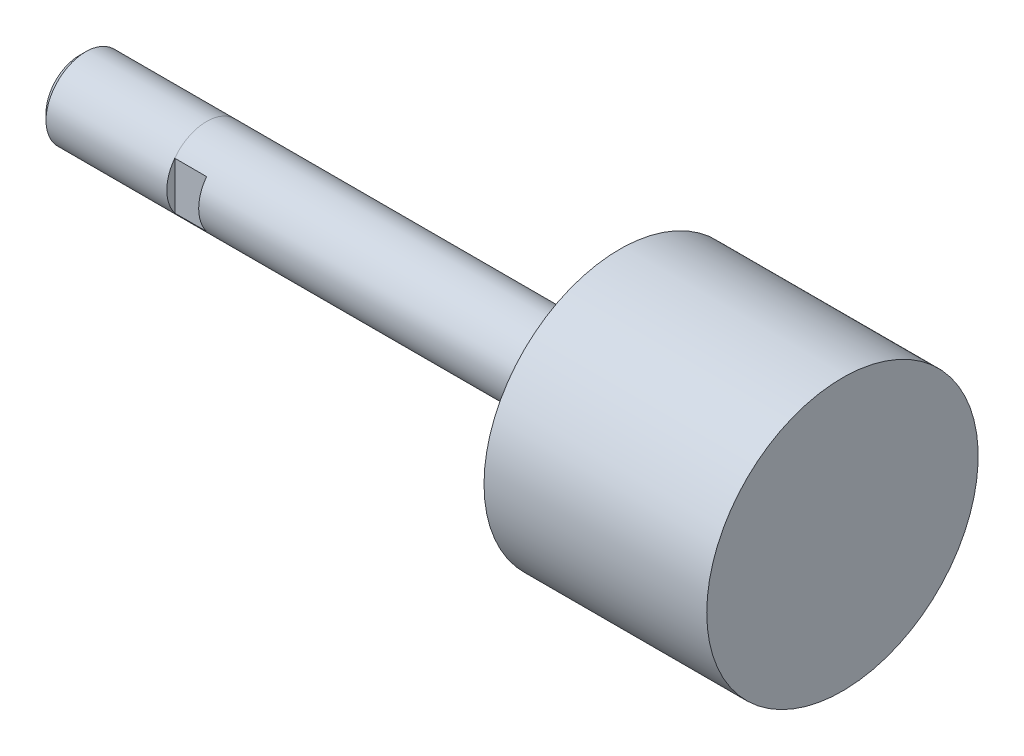
ISO-10303-21;
HEADER;
FILE_DESCRIPTION(('STEP AP214'),'2;1');
FILE_NAME('part.step','',(''),(''),'','','');
FILE_SCHEMA(('AUTOMOTIVE_DESIGN { 1 0 10303 214 1 1 1 1 }'));
ENDSEC;
DATA;
#1=APPLICATION_CONTEXT('core data for automotive mechanical design processes');
#2=APPLICATION_PROTOCOL_DEFINITION('international standard','automotive_design',2000,#1);
#3=PRODUCT_CONTEXT('',#1,'mechanical');
#4=PRODUCT('Part','Part','',(#3));
#5=PRODUCT_RELATED_PRODUCT_CATEGORY('part','',(#4));
#6=PRODUCT_DEFINITION_FORMATION('','',#4);
#7=PRODUCT_DEFINITION_CONTEXT('part definition',#1,'design');
#8=PRODUCT_DEFINITION('design','',#6,#7);
#9=PRODUCT_DEFINITION_SHAPE('','',#8);
#10=(LENGTH_UNIT() NAMED_UNIT(*) SI_UNIT(.MILLI.,.METRE.));
#11=(NAMED_UNIT(*) PLANE_ANGLE_UNIT() SI_UNIT($,.RADIAN.));
#12=(NAMED_UNIT(*) SI_UNIT($,.STERADIAN.) SOLID_ANGLE_UNIT());
#13=UNCERTAINTY_MEASURE_WITH_UNIT(LENGTH_MEASURE(1.E-05),#10,'distance_accuracy_value','');
#14=(GEOMETRIC_REPRESENTATION_CONTEXT(3) GLOBAL_UNCERTAINTY_ASSIGNED_CONTEXT((#13)) GLOBAL_UNIT_ASSIGNED_CONTEXT((#10,
#11,#12)) REPRESENTATION_CONTEXT('',''));
#15=CARTESIAN_POINT('',(0.,0.,0.));
#16=DIRECTION('',(0.,0.,1.));
#17=DIRECTION('',(1.,0.,0.));
#18=AXIS2_PLACEMENT_3D('',#15,#16,#17);
#19=CARTESIAN_POINT('',(60.3504,0.,0.));
#20=DIRECTION('',(-1.,0.,0.));
#21=DIRECTION('',(0.,0.,1.));
#22=AXIS2_PLACEMENT_3D('',#19,#20,#21);
#23=CYLINDRICAL_SURFACE('',#22,3.9624);
#24=DIRECTION('',(-1.,0.,0.));
#25=VECTOR('',#24,1.);
#26=CARTESIAN_POINT('',(60.3504,2.37065154757084,-3.175));
#27=LINE('',#26,#25);
#28=CARTESIAN_POINT('',(0.,2.37065154757084,-3.175));
#29=VERTEX_POINT('',#28);
#30=CARTESIAN_POINT('',(-3.175,2.37595077378542,-3.175));
#31=VERTEX_POINT('',#30);
#32=EDGE_CURVE('E100',#29,#31,#27,.T.);
#33=ORIENTED_EDGE('',*,*,#32,.T.);
#34=CARTESIAN_POINT('',(-3.175,0.,0.));
#35=DIRECTION('',(-1.,0.,0.));
#36=DIRECTION('',(0.,0.599143734238293,0.800641483888384));
#37=AXIS2_PLACEMENT_3D('',#34,#35,#36);
#38=CIRCLE('',#37,3.96875);
#39=CARTESIAN_POINT('',(-3.175,2.37594941390202,3.17500385247068));
#40=VERTEX_POINT('',#39);
#41=EDGE_CURVE('E80',#40,#31,#38,.T.);
#42=ORIENTED_EDGE('',*,*,#41,.F.);
#43=DIRECTION('',(-1.,0.,0.));
#44=VECTOR('',#43,1.);
#45=CARTESIAN_POINT('',(60.3504,2.37065154757084,3.175));
#46=LINE('',#45,#44);
#47=CARTESIAN_POINT('',(0.,2.37065154757084,3.175));
#48=VERTEX_POINT('',#47);
#49=EDGE_CURVE('E109',#40,#48,#46,.F.);
#50=ORIENTED_EDGE('',*,*,#49,.T.);
#51=CARTESIAN_POINT('',(0.,0.,0.));
#52=DIRECTION('',(1.,0.,0.));
#53=DIRECTION('',(0.,0.,-1.));
#54=AXIS2_PLACEMENT_3D('',#51,#52,#53);
#55=CIRCLE('',#54,3.9624);
#56=CARTESIAN_POINT('',(0.,-2.37065154757084,3.175));
#57=VERTEX_POINT('',#56);
#58=EDGE_CURVE('E11',#48,#57,#55,.T.);
#59=ORIENTED_EDGE('',*,*,#58,.T.);
#60=DIRECTION('',(-1.,0.,0.));
#61=VECTOR('',#60,1.);
#62=CARTESIAN_POINT('',(60.3504,-2.37065154757084,3.175));
#63=LINE('',#62,#61);
#64=CARTESIAN_POINT('',(-3.175,-2.37595077378542,3.175));
#65=VERTEX_POINT('',#64);
#66=EDGE_CURVE('E111',#57,#65,#63,.T.);
#67=ORIENTED_EDGE('',*,*,#66,.T.);
#68=CARTESIAN_POINT('',(-3.175,0.,0.));
#69=DIRECTION('',(-1.,0.,0.));
#70=DIRECTION('',(0.,-0.599143734238397,-0.800641483888306));
#71=AXIS2_PLACEMENT_3D('',#68,#69,#70);
#72=CIRCLE('',#71,3.96875);
#73=CARTESIAN_POINT('',(-3.17500000000001,-2.37594941390243,-3.17500385247037));
#74=VERTEX_POINT('',#73);
#75=EDGE_CURVE('E94',#74,#65,#72,.T.);
#76=ORIENTED_EDGE('',*,*,#75,.F.);
#77=DIRECTION('',(-1.,0.,0.));
#78=VECTOR('',#77,1.);
#79=CARTESIAN_POINT('',(60.3504,-2.37065154757084,-3.175));
#80=LINE('',#79,#78);
#81=CARTESIAN_POINT('',(0.,-2.37065154757084,-3.175));
#82=VERTEX_POINT('',#81);
#83=EDGE_CURVE('E103',#74,#82,#80,.F.);
#84=ORIENTED_EDGE('',*,*,#83,.T.);
#85=EDGE_CURVE('E40',#82,#29,#55,.T.);
#86=ORIENTED_EDGE('',*,*,#85,.T.);
#87=EDGE_LOOP('',(#33,#42,#50,#59,#67,#76,#84,#86));
#88=FACE_BOUND('',#87,.T.);
#89=CARTESIAN_POINT('',(38.1,0.,0.));
#90=DIRECTION('',(-1.,0.,0.));
#91=DIRECTION('',(0.,0.,1.));
#92=AXIS2_PLACEMENT_3D('',#89,#90,#91);
#93=CIRCLE('',#92,3.9624);
#94=CARTESIAN_POINT('',(38.1,0.,3.9624));
#95=VERTEX_POINT('',#94);
#96=EDGE_CURVE('E199',#95,#95,#93,.T.);
#97=ORIENTED_EDGE('',*,*,#96,.T.);
#98=EDGE_LOOP('',(#97));
#99=FACE_BOUND('',#98,.T.);
#100=ADVANCED_FACE('F36',(#88,#99),#23,.T.);
#101=CARTESIAN_POINT('',(38.1,3.9624,0.));
#102=DIRECTION('',(1.,0.,0.));
#103=DIRECTION('',(0.,0.,-1.));
#104=AXIS2_PLACEMENT_3D('',#101,#102,#103);
#105=PLANE('',#104);
#106=ORIENTED_EDGE('',*,*,#96,.F.);
#107=EDGE_LOOP('',(#106));
#108=FACE_BOUND('',#107,.T.);
#109=CARTESIAN_POINT('',(38.1,0.,0.));
#110=DIRECTION('',(-1.,0.,0.));
#111=DIRECTION('',(0.,0.,1.));
#112=AXIS2_PLACEMENT_3D('',#109,#110,#111);
#113=CIRCLE('',#112,13.55725);
#114=CARTESIAN_POINT('',(38.1,0.,13.55725));
#115=VERTEX_POINT('',#114);
#116=EDGE_CURVE('E201',#115,#115,#113,.T.);
#117=ORIENTED_EDGE('',*,*,#116,.T.);
#118=EDGE_LOOP('',(#117));
#119=FACE_BOUND('',#118,.T.);
#120=ADVANCED_FACE('F219',(#108,#119),#105,.F.);
#121=CARTESIAN_POINT('',(60.3504,0.,0.));
#122=DIRECTION('',(-1.,0.,0.));
#123=DIRECTION('',(0.,0.,1.));
#124=AXIS2_PLACEMENT_3D('',#121,#122,#123);
#125=CYLINDRICAL_SURFACE('',#124,13.55725);
#126=ORIENTED_EDGE('',*,*,#116,.F.);
#127=EDGE_LOOP('',(#126));
#128=FACE_BOUND('',#127,.T.);
#129=CARTESIAN_POINT('',(60.3504,0.,0.));
#130=DIRECTION('',(-1.,0.,0.));
#131=DIRECTION('',(0.,0.,1.));
#132=AXIS2_PLACEMENT_3D('',#129,#130,#131);
#133=CIRCLE('',#132,13.55725);
#134=CARTESIAN_POINT('',(60.3504,0.,13.55725));
#135=VERTEX_POINT('',#134);
#136=EDGE_CURVE('E144',#135,#135,#133,.T.);
#137=ORIENTED_EDGE('',*,*,#136,.T.);
#138=EDGE_LOOP('',(#137));
#139=FACE_BOUND('',#138,.T.);
#140=ADVANCED_FACE('F208',(#128,#139),#125,.T.);
#141=CARTESIAN_POINT('',(60.3504,13.55725,0.));
#142=DIRECTION('',(-1.,0.,0.));
#143=DIRECTION('',(0.,0.,1.));
#144=AXIS2_PLACEMENT_3D('',#141,#142,#143);
#145=PLANE('',#144);
#146=ORIENTED_EDGE('',*,*,#136,.F.);
#147=EDGE_LOOP('',(#146));
#148=FACE_BOUND('',#147,.T.);
#149=ADVANCED_FACE('F210',(#148),#145,.F.);
#150=CARTESIAN_POINT('',(-15.875,0.,0.));
#151=DIRECTION('',(1.,0.,0.));
#152=DIRECTION('',(0.,0.,-1.));
#153=AXIS2_PLACEMENT_3D('',#150,#151,#152);
#154=PLANE('',#153);
#155=CARTESIAN_POINT('',(-15.875,0.,0.));
#156=DIRECTION('',(-1.,0.,0.));
#157=DIRECTION('',(0.,0.,1.));
#158=AXIS2_PLACEMENT_3D('',#155,#156,#157);
#159=CIRCLE('',#158,3.33883);
#160=CARTESIAN_POINT('',(-15.875,0.,3.33883));
#161=VERTEX_POINT('',#160);
#162=EDGE_CURVE('E137',#161,#161,#159,.T.);
#163=ORIENTED_EDGE('',*,*,#162,.T.);
#164=EDGE_LOOP('',(#163));
#165=FACE_BOUND('',#164,.T.);
#166=ADVANCED_FACE('F212',(#165),#154,.F.);
#167=CARTESIAN_POINT('',(-15.24508,0.,0.));
#168=DIRECTION('',(1.,0.,0.));
#169=DIRECTION('',(0.,0.,-1.));
#170=AXIS2_PLACEMENT_3D('',#167,#168,#169);
#171=CONICAL_SURFACE('',#170,3.96875,0.785398163397449);
#172=ORIENTED_EDGE('',*,*,#162,.F.);
#173=EDGE_LOOP('',(#172));
#174=FACE_BOUND('',#173,.T.);
#175=CARTESIAN_POINT('',(-15.24508,0.,0.));
#176=DIRECTION('',(-1.,0.,0.));
#177=DIRECTION('',(0.,0.,1.));
#178=AXIS2_PLACEMENT_3D('',#175,#176,#177);
#179=CIRCLE('',#178,3.96875);
#180=CARTESIAN_POINT('',(-15.24508,0.,3.96875));
#181=VERTEX_POINT('',#180);
#182=EDGE_CURVE('E134',#181,#181,#179,.T.);
#183=ORIENTED_EDGE('',*,*,#182,.T.);
#184=EDGE_LOOP('',(#183));
#185=FACE_BOUND('',#184,.T.);
#186=ADVANCED_FACE('F172',(#174,#185),#171,.T.);
#187=CARTESIAN_POINT('',(-3.175,0.,0.));
#188=DIRECTION('',(-1.,0.,0.));
#189=DIRECTION('',(0.,0.,1.));
#190=AXIS2_PLACEMENT_3D('',#187,#188,#189);
#191=CYLINDRICAL_SURFACE('',#190,3.96875);
#192=ORIENTED_EDGE('',*,*,#182,.F.);
#193=EDGE_LOOP('',(#192));
#194=FACE_BOUND('',#193,.T.);
#195=ORIENTED_EDGE('',*,*,#41,.T.);
#196=CARTESIAN_POINT('',(-3.175,0.,0.));
#197=DIRECTION('',(-1.,0.,0.));
#198=DIRECTION('',(0.,0.599143734238395,-0.800641483888308));
#199=AXIS2_PLACEMENT_3D('',#196,#197,#198);
#200=CIRCLE('',#199,3.96875);
#201=EDGE_CURVE('E83',#31,#74,#200,.T.);
#202=ORIENTED_EDGE('',*,*,#201,.T.);
#203=ORIENTED_EDGE('',*,*,#75,.T.);
#204=CARTESIAN_POINT('',(-3.175,0.,0.));
#205=DIRECTION('',(-1.,0.,0.));
#206=DIRECTION('',(0.,-0.599143734238393,0.800641483888309));
#207=AXIS2_PLACEMENT_3D('',#204,#205,#206);
#208=CIRCLE('',#207,3.96875);
#209=EDGE_CURVE('E85',#65,#40,#208,.T.);
#210=ORIENTED_EDGE('',*,*,#209,.T.);
#211=EDGE_LOOP('',(#195,#202,#203,#210));
#212=FACE_BOUND('',#211,.T.);
#213=ADVANCED_FACE('F82',(#194,#212),#191,.T.);
#214=CARTESIAN_POINT('',(-3.175,0.,0.));
#215=DIRECTION('',(1.,0.,0.));
#216=DIRECTION('',(0.,0.,-1.));
#217=AXIS2_PLACEMENT_3D('',#214,#215,#216);
#218=PLANE('',#217);
#219=ORIENTED_EDGE('',*,*,#201,.F.);
#220=DIRECTION('',(0.,1.,0.));
#221=VECTOR('',#220,1.);
#222=CARTESIAN_POINT('',(-3.175,-3.9624,-3.175));
#223=LINE('',#222,#221);
#224=EDGE_CURVE('E50',#74,#31,#223,.T.);
#225=ORIENTED_EDGE('',*,*,#224,.F.);
#226=EDGE_LOOP('',(#219,#225));
#227=FACE_BOUND('',#226,.T.);
#228=ADVANCED_FACE('F93',(#227),#218,.T.);
#229=CARTESIAN_POINT('',(0.,-3.9624,-3.175));
#230=DIRECTION('',(0.,0.,1.));
#231=DIRECTION('',(1.,0.,0.));
#232=AXIS2_PLACEMENT_3D('',#229,#230,#231);
#233=PLANE('',#232);
#234=DIRECTION('',(0.,1.,0.));
#235=VECTOR('',#234,1.);
#236=CARTESIAN_POINT('',(0.,-3.9624,-3.175));
#237=LINE('',#236,#235);
#238=EDGE_CURVE('E113',#82,#29,#237,.T.);
#239=ORIENTED_EDGE('',*,*,#238,.F.);
#240=ORIENTED_EDGE('',*,*,#83,.F.);
#241=ORIENTED_EDGE('',*,*,#224,.T.);
#242=ORIENTED_EDGE('',*,*,#32,.F.);
#243=EDGE_LOOP('',(#239,#240,#241,#242));
#244=FACE_BOUND('',#243,.T.);
#245=ADVANCED_FACE('F99',(#244),#233,.F.);
#246=CARTESIAN_POINT('',(0.,0.,0.));
#247=DIRECTION('',(1.,0.,0.));
#248=DIRECTION('',(0.,0.,-1.));
#249=AXIS2_PLACEMENT_3D('',#246,#247,#248);
#250=PLANE('',#249);
#251=ORIENTED_EDGE('',*,*,#238,.T.);
#252=ORIENTED_EDGE('',*,*,#85,.F.);
#253=EDGE_LOOP('',(#251,#252));
#254=FACE_BOUND('',#253,.T.);
#255=ADVANCED_FACE('F260',(#254),#250,.F.);
#256=DIRECTION('',(0.,-1.,0.));
#257=VECTOR('',#256,1.);
#258=CARTESIAN_POINT('',(0.,3.9624,3.175));
#259=LINE('',#258,#257);
#260=EDGE_CURVE('E105',#48,#57,#259,.T.);
#261=ORIENTED_EDGE('',*,*,#260,.T.);
#262=ORIENTED_EDGE('',*,*,#58,.F.);
#263=EDGE_LOOP('',(#261,#262));
#264=FACE_BOUND('',#263,.T.);
#265=ADVANCED_FACE('F130',(#264),#250,.F.);
#266=ORIENTED_EDGE('',*,*,#209,.F.);
#267=DIRECTION('',(0.,-1.,0.));
#268=VECTOR('',#267,1.);
#269=CARTESIAN_POINT('',(-3.175,3.9624,3.175));
#270=LINE('',#269,#268);
#271=EDGE_CURVE('E57',#40,#65,#270,.T.);
#272=ORIENTED_EDGE('',*,*,#271,.F.);
#273=EDGE_LOOP('',(#266,#272));
#274=FACE_BOUND('',#273,.T.);
#275=ADVANCED_FACE('F150',(#274),#218,.T.);
#276=CARTESIAN_POINT('',(0.,3.9624,3.175));
#277=DIRECTION('',(0.,0.,-1.));
#278=DIRECTION('',(-1.,0.,0.));
#279=AXIS2_PLACEMENT_3D('',#276,#277,#278);
#280=PLANE('',#279);
#281=ORIENTED_EDGE('',*,*,#260,.F.);
#282=ORIENTED_EDGE('',*,*,#49,.F.);
#283=ORIENTED_EDGE('',*,*,#271,.T.);
#284=ORIENTED_EDGE('',*,*,#66,.F.);
#285=EDGE_LOOP('',(#281,#282,#283,#284));
#286=FACE_BOUND('',#285,.T.);
#287=ADVANCED_FACE('F133',(#286),#280,.F.);
#288=CLOSED_SHELL('',(#100,#120,#140,#149,#166,#186,#213,#228,#245,#255,#265,#275,#287));
#289=MANIFOLD_SOLID_BREP('B2',#288);
#290=ADVANCED_BREP_SHAPE_REPRESENTATION('',(#18,#289),#14);
#291=SHAPE_DEFINITION_REPRESENTATION(#9,#290);
ENDSEC;
END-ISO-10303-21;
